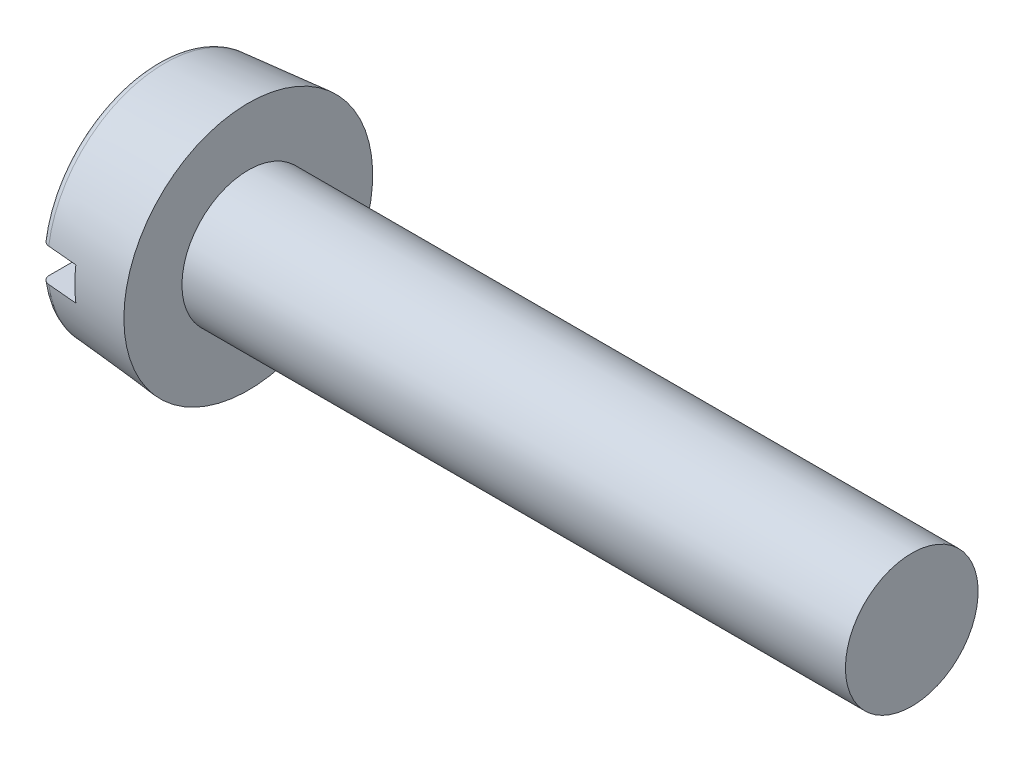
ISO-10303-21;
HEADER;
FILE_DESCRIPTION(('STEP AP214'),'2;1');
FILE_NAME('part.step','',(''),(''),'','','');
FILE_SCHEMA(('AUTOMOTIVE_DESIGN { 1 0 10303 214 1 1 1 1 }'));
ENDSEC;
DATA;
#1=APPLICATION_CONTEXT('core data for automotive mechanical design processes');
#2=APPLICATION_PROTOCOL_DEFINITION('international standard','automotive_design',2000,#1);
#3=PRODUCT_CONTEXT('',#1,'mechanical');
#4=PRODUCT('Part','Part','',(#3));
#5=PRODUCT_RELATED_PRODUCT_CATEGORY('part','',(#4));
#6=PRODUCT_DEFINITION_FORMATION('','',#4);
#7=PRODUCT_DEFINITION_CONTEXT('part definition',#1,'design');
#8=PRODUCT_DEFINITION('design','',#6,#7);
#9=PRODUCT_DEFINITION_SHAPE('','',#8);
#10=(LENGTH_UNIT() NAMED_UNIT(*) SI_UNIT(.MILLI.,.METRE.));
#11=(NAMED_UNIT(*) PLANE_ANGLE_UNIT() SI_UNIT($,.RADIAN.));
#12=(NAMED_UNIT(*) SI_UNIT($,.STERADIAN.) SOLID_ANGLE_UNIT());
#13=UNCERTAINTY_MEASURE_WITH_UNIT(LENGTH_MEASURE(1.E-05),#10,'distance_accuracy_value','');
#14=(GEOMETRIC_REPRESENTATION_CONTEXT(3) GLOBAL_UNCERTAINTY_ASSIGNED_CONTEXT((#13)) GLOBAL_UNIT_ASSIGNED_CONTEXT((#10,
#11,#12)) REPRESENTATION_CONTEXT('',''));
#15=CARTESIAN_POINT('',(0.,0.,0.));
#16=DIRECTION('',(0.,0.,1.));
#17=DIRECTION('',(1.,0.,0.));
#18=AXIS2_PLACEMENT_3D('',#15,#16,#17);
#19=CARTESIAN_POINT('',(0.,0.,0.));
#20=DIRECTION('',(-1.,0.,0.));
#21=DIRECTION('',(0.,0.,1.));
#22=AXIS2_PLACEMENT_3D('',#19,#20,#21);
#23=PLANE('',#22);
#24=DIRECTION('',(0.,0.,-1.));
#25=VECTOR('',#24,1.);
#26=CARTESIAN_POINT('',(0.,0.2,1.5));
#27=LINE('',#26,#25);
#28=CARTESIAN_POINT('',(0.,0.2,1.29679737749146));
#29=VERTEX_POINT('',#28);
#30=CARTESIAN_POINT('',(0.,0.2,-1.29679737749146));
#31=VERTEX_POINT('',#30);
#32=EDGE_CURVE('E104',#29,#31,#27,.T.);
#33=ORIENTED_EDGE('',*,*,#32,.F.);
#34=CARTESIAN_POINT('',(0.,0.,0.));
#35=DIRECTION('',(-1.,0.,0.));
#36=DIRECTION('',(0.,0.,1.));
#37=AXIS2_PLACEMENT_3D('',#34,#35,#36);
#38=CIRCLE('',#37,1.31212935271974);
#39=EDGE_CURVE('E106',#29,#31,#38,.T.);
#40=ORIENTED_EDGE('',*,*,#39,.T.);
#41=EDGE_LOOP('',(#33,#40));
#42=FACE_BOUND('',#41,.T.);
#43=ADVANCED_FACE('F35',(#42),#23,.T.);
#44=CARTESIAN_POINT('',(0.1,0.,0.));
#45=DIRECTION('',(-1.,0.,0.));
#46=DIRECTION('',(0.,0.,1.));
#47=AXIS2_PLACEMENT_3D('',#44,#45,#46);
#48=TOROIDAL_SURFACE('',#47,1.31212935271974,0.1);
#49=CARTESIAN_POINT('',(0.0414806405140106,0.2,-1.37878873869132));
#50=CARTESIAN_POINT('',(0.045992706268456,0.2,-1.38207872080672));
#51=CARTESIAN_POINT('',(0.0507840970123343,0.2,-1.384992124698));
#52=CARTESIAN_POINT('',(0.0607913614850068,0.2,-1.38997655926365));
#53=CARTESIAN_POINT('',(0.0660076927554337,0.2,-1.39204666716679));
#54=CARTESIAN_POINT('',(0.0767138026794469,0.2,-1.39527943903315));
#55=CARTESIAN_POINT('',(0.0822035244640968,0.2,-1.3964422908861));
#56=CARTESIAN_POINT('',(0.0932990891068805,0.2,-1.39782558793083));
#57=CARTESIAN_POINT('',(0.0989049042338715,0.2,-1.39804625563095));
#58=CARTESIAN_POINT('',(0.110053313509891,0.2,-1.39754017359693));
#59=CARTESIAN_POINT('',(0.115596062569045,0.2,-1.39681683029812));
#60=CARTESIAN_POINT('',(0.126481642138175,0.2,-1.39445028085468));
#61=CARTESIAN_POINT('',(0.131824467027574,0.2,-1.3928070488694));
#62=CARTESIAN_POINT('',(0.142162597863389,0.2,-1.38864842807059));
#63=CARTESIAN_POINT('',(0.147157700121292,0.2,-1.38613253314648));
#64=CARTESIAN_POINT('',(0.156658159294591,0.2,-1.38030289352851));
#65=CARTESIAN_POINT('',(0.161163504734715,0.2,-1.37698913014599));
#66=CARTESIAN_POINT('',(0.169588111305702,0.2,-1.36963647561987));
#67=CARTESIAN_POINT('',(0.173503473129932,0.2,-1.36559311777687));
#68=CARTESIAN_POINT('',(0.180607831648186,0.2,-1.35691211057948));
#69=CARTESIAN_POINT('',(0.183796794165209,0.2,-1.35227443327847));
#70=CARTESIAN_POINT('',(0.189391769491923,0.2,-1.3424874153805));
#71=CARTESIAN_POINT('',(0.191789700880553,0.2,-1.33733345509101));
#72=CARTESIAN_POINT('',(0.19569590317085,0.2,-1.32669877950339));
#73=CARTESIAN_POINT('',(0.197204123257214,0.2,-1.32121804556149));
#74=CARTESIAN_POINT('',(0.199302643953413,0.2,-1.31002730595364));
#75=CARTESIAN_POINT('',(0.199883711661166,0.2,-1.30431556796017));
#76=CARTESIAN_POINT('',(0.200084708962473,0.2,-1.29287512483865));
#77=CARTESIAN_POINT('',(0.199704598358244,0.2,-1.287146419011));
#78=CARTESIAN_POINT('',(0.197988994443503,0.2,-1.27579996619359));
#79=CARTESIAN_POINT('',(0.196648015633941,0.2,-1.27018304748093));
#80=CARTESIAN_POINT('',(0.193040788100539,0.2,-1.25925443041696));
#81=CARTESIAN_POINT('',(0.190774533693605,0.2,-1.25394273394057));
#82=CARTESIAN_POINT('',(0.18538205629663,0.2,-1.24378559136757));
#83=CARTESIAN_POINT('',(0.182257151707113,0.2,-1.23893944572103));
#84=CARTESIAN_POINT('',(0.175231140293912,0.2,-1.22984670234343));
#85=CARTESIAN_POINT('',(0.171330065880049,0.2,-1.22560007959128));
#86=CARTESIAN_POINT('',(0.162899083220666,0.2,-1.21786965873921));
#87=CARTESIAN_POINT('',(0.158375208316466,0.2,-1.21437928244762));
#88=CARTESIAN_POINT('',(0.148799353097061,0.2,-1.20821933397743));
#89=CARTESIAN_POINT('',(0.143747412157135,0.2,-1.20554970065849));
#90=CARTESIAN_POINT('',(0.133328828939664,0.2,-1.20114330406563));
#91=CARTESIAN_POINT('',(0.127967091422443,0.2,-1.19939494244297));
#92=CARTESIAN_POINT('',(0.117024703752107,0.2,-1.19683371135137));
#93=CARTESIAN_POINT('',(0.111444068408559,0.2,-1.19602077870833));
#94=CARTESIAN_POINT('',(0.100283556423155,0.2,-1.19535934874535));
#95=CARTESIAN_POINT('',(0.0947042584312154,0.2,-1.19550105044551));
#96=CARTESIAN_POINT('',(0.0836492282236536,0.2,-1.19672136311714));
#97=CARTESIAN_POINT('',(0.0781734935834735,0.2,-1.197799952127));
#98=CARTESIAN_POINT('',(0.0674919809063741,0.2,-1.20085751924297));
#99=CARTESIAN_POINT('',(0.0622856685568473,0.2,-1.20283463270732));
#100=CARTESIAN_POINT('',(0.0522755234585236,0.2,-1.20762882764349));
#101=CARTESIAN_POINT('',(0.0474717016780087,0.2,-1.2104459319964));
#102=CARTESIAN_POINT('',(0.038364797689681,0.2,-1.2168597921199));
#103=CARTESIAN_POINT('',(0.03406554388611,0.2,-1.22046198166932));
#104=CARTESIAN_POINT('',(0.0261235169004913,0.2,-1.22832895956775));
#105=CARTESIAN_POINT('',(0.0224807858537098,0.2,-1.23259379041202));
#106=CARTESIAN_POINT('',(0.0159068726282138,0.2,-1.24172167849697));
#107=CARTESIAN_POINT('',(0.0129851152821255,0.2,-1.24659152346576));
#108=CARTESIAN_POINT('',(0.00798981751689208,0.2,-1.25674837943574));
#109=CARTESIAN_POINT('',(0.00591633420418645,0.2,-1.26203541849418));
#110=CARTESIAN_POINT('',(0.00265314843626462,0.2,-1.27294200497139));
#111=CARTESIAN_POINT('',(0.00147388322806701,0.2,-1.27856467692328));
#112=CARTESIAN_POINT('',(7.04341788945292E-05,0.2,-1.28992785871544));
#113=CARTESIAN_POINT('',(-0.000153748687010346,0.2,-1.29566836867603));
#114=CARTESIAN_POINT('',(0.000361012752478395,0.2,-1.30713657329263));
#115=CARTESIAN_POINT('',(0.00110504408471955,0.2,-1.31286404059237));
#116=CARTESIAN_POINT('',(0.00354671167517866,0.2,-1.32411374262448));
#117=CARTESIAN_POINT('',(0.00524458054571486,0.2,-1.32963592694413));
#118=CARTESIAN_POINT('',(0.00954431574689398,0.2,-1.34030328003271));
#119=CARTESIAN_POINT('',(0.0121443890017295,0.2,-1.34544917228006));
#120=CARTESIAN_POINT('',(0.018177136481899,0.2,-1.35522154229951));
#121=CARTESIAN_POINT('',(0.0216087742263154,0.2,-1.35984865626817));
#122=CARTESIAN_POINT('',(0.0278105047502973,0.2,-1.36686955431054));
#123=CARTESIAN_POINT('',(0.0303616325878246,0.2,-1.36946003192939));
#124=CARTESIAN_POINT('',(0.0357293321890374,0.2,-1.37434968831504));
#125=CARTESIAN_POINT('',(0.0385459026655175,0.2,-1.37664886849429));
#126=CARTESIAN_POINT('',(0.0414806405140106,0.2,-1.37878873869132));
#127=B_SPLINE_CURVE_WITH_KNOTS('',3,(#49,#50,#51,#52,#53,#54,#55,#56,#57,#58,#59,#60,#61,#62,
#63,#64,#65,#66,#67,#68,#69,#70,#71,#72,#73,#74,#75,#76,#77,#78,#79,#80,#81,#82,#83,#84,#85,#86,
#87,#88,#89,#90,#91,#92,#93,#94,#95,#96,#97,#98,#99,#100,#101,#102,#103,#104,#105,#106,#107,
#108,#109,#110,#111,#112,#113,#114,#115,#116,#117,#118,#119,#120,#121,#122,#123,#124,#125,#126),
.UNSPECIFIED.,.T.,.F.,(4,2,2,2,2,2,2,2,2,2,2,2,2,2,2,2,2,2,2,2,2,2,2,2,2,2,2,2,2,2,2,2,2,2,2,2,
2,2,4),(0.,0.0167393128294365,0.0334968936586767,0.0502510031263279,0.0670011556866522,
0.0836910326253862,0.100381378423866,0.117081420203452,0.133781853189951,0.150588230195742,
0.167395397776329,0.184369307268852,0.201344186121747,0.218487074698843,0.235630680226664,
0.25287294469584,0.270115315069563,0.287331357453451,0.30454668111342,0.321605642871932,
0.338663333533964,0.355500810610574,0.372337150503218,0.389000901452267,0.40566426179629,
0.422293198693181,0.438922588598416,0.455670952608406,0.472420391136634,0.489378389754252,
0.506337529809178,0.523491691763249,0.540645871230475,0.557890544200038,0.575139424453957,
0.592354218129328,0.609547664273803,0.620435301069003,0.631322885069728),.UNSPECIFIED.);
#128=CARTESIAN_POINT('',(0.0912844257255021,0.2,-1.39751019242307));
#129=VERTEX_POINT('',#128);
#130=EDGE_CURVE('E59',#31,#129,#127,.T.);
#131=ORIENTED_EDGE('',*,*,#130,.F.);
#132=ORIENTED_EDGE('',*,*,#39,.F.);
#133=CARTESIAN_POINT('',(0.0307819679804513,0.2,1.22372100362098));
#134=CARTESIAN_POINT('',(0.0347984727964817,0.2,1.2198181323119));
#135=CARTESIAN_POINT('',(0.0391440859190338,0.2,1.21624856527496));
#136=CARTESIAN_POINT('',(0.0483749943226639,0.2,1.20988450674902));
#137=CARTESIAN_POINT('',(0.0532608509416966,0.2,1.20709083223231));
#138=CARTESIAN_POINT('',(0.0634341852694045,0.2,1.20236616989635));
#139=CARTESIAN_POINT('',(0.0687216716373827,0.2,1.20043520068357));
#140=CARTESIAN_POINT('',(0.0795460311047977,0.2,1.19749672442106));
#141=CARTESIAN_POINT('',(0.085082841985754,0.2,1.19648898830541));
#142=CARTESIAN_POINT('',(0.0962052821839367,0.2,1.19543166840146));
#143=CARTESIAN_POINT('',(0.101790235157893,0.2,1.19537496403138));
#144=CARTESIAN_POINT('',(0.11288990404888,0.2,1.19620324026988));
#145=CARTESIAN_POINT('',(0.118404619469681,0.2,1.19708822752781));
#146=CARTESIAN_POINT('',(0.129190042563905,0.2,1.19976830100141));
#147=CARTESIAN_POINT('',(0.13446144689838,0.2,1.20156058690718));
#148=CARTESIAN_POINT('',(0.144631252407818,0.2,1.2059993116385));
#149=CARTESIAN_POINT('',(0.149529645729798,0.2,1.20864576844073));
#150=CARTESIAN_POINT('',(0.158848822688909,0.2,1.21473343117123));
#151=CARTESIAN_POINT('',(0.163266401386561,0.2,1.21817954121337));
#152=CARTESIAN_POINT('',(0.171469077513323,0.2,1.22575630231456));
#153=CARTESIAN_POINT('',(0.175254137803147,0.2,1.22988699354151));
#154=CARTESIAN_POINT('',(0.182133700549108,0.2,1.23876924128591));
#155=CARTESIAN_POINT('',(0.185219228809023,0.2,1.24352774826054));
#156=CARTESIAN_POINT('',(0.190558601135525,0.2,1.25349047166616));
#157=CARTESIAN_POINT('',(0.192812388984713,0.2,1.25869471819543));
#158=CARTESIAN_POINT('',(0.196450900985209,0.2,1.26946767434103));
#159=CARTESIAN_POINT('',(0.197824993630129,0.2,1.27503997639372));
#160=CARTESIAN_POINT('',(0.199624620171047,0.2,1.28633578370974));
#161=CARTESIAN_POINT('',(0.200050113493286,0.2,1.29205929543005));
#162=CARTESIAN_POINT('',(0.199940149302512,0.2,1.30353259953747));
#163=CARTESIAN_POINT('',(0.199398749112752,0.2,1.30928233630723));
#164=CARTESIAN_POINT('',(0.197356810660867,0.2,1.32060904673091));
#165=CARTESIAN_POINT('',(0.19585627018755,0.2,1.32618601998652));
#166=CARTESIAN_POINT('',(0.19193877358236,0.2,1.33699794176707));
#167=CARTESIAN_POINT('',(0.18952334691576,0.2,1.34223344411769));
#168=CARTESIAN_POINT('',(0.183840984141119,0.2,1.3522201065835));
#169=CARTESIAN_POINT('',(0.180574079318981,0.2,1.35697128448533));
#170=CARTESIAN_POINT('',(0.173308450638201,0.2,1.36581299081948));
#171=CARTESIAN_POINT('',(0.169315781908923,0.2,1.36990849402998));
#172=CARTESIAN_POINT('',(0.160693107410107,0.2,1.37736235484011));
#173=CARTESIAN_POINT('',(0.156063138036668,0.2,1.38072075450717));
#174=CARTESIAN_POINT('',(0.146349474679739,0.2,1.38656781412274));
#175=CARTESIAN_POINT('',(0.141271049827143,0.2,1.38906522819464));
#176=CARTESIAN_POINT('',(0.130764444251643,0.2,1.39316337799611));
#177=CARTESIAN_POINT('',(0.125336282236047,0.2,1.39476416164177));
#178=CARTESIAN_POINT('',(0.114335380158321,0.2,1.39701043035063));
#179=CARTESIAN_POINT('',(0.10876432073887,0.2,1.39766415168206));
#180=CARTESIAN_POINT('',(0.0975918067789705,0.2,1.39802299033389));
#181=CARTESIAN_POINT('',(0.0919903531471776,0.2,1.39772813585832));
#182=CARTESIAN_POINT('',(0.0809388039751648,0.2,1.39620176248313));
#183=CARTESIAN_POINT('',(0.0754882068414214,0.2,1.39497387054489));
#184=CARTESIAN_POINT('',(0.0648698422524552,0.2,1.39162243053316));
#185=CARTESIAN_POINT('',(0.0597020751209219,0.2,1.38949888143465));
#186=CARTESIAN_POINT('',(0.049782502927804,0.2,1.38441312808557));
#187=CARTESIAN_POINT('',(0.0450316678762765,0.2,1.38144903263922));
#188=CARTESIAN_POINT('',(0.0360902176627494,0.2,1.3747709553496));
#189=CARTESIAN_POINT('',(0.0318996217996732,0.2,1.37105694768467));
#190=CARTESIAN_POINT('',(0.024162729133194,0.2,1.36295514115609));
#191=CARTESIAN_POINT('',(0.0206215709141188,0.2,1.35856243612017));
#192=CARTESIAN_POINT('',(0.0143180732840832,0.2,1.34924994940869));
#193=CARTESIAN_POINT('',(0.0115557764252828,0.2,1.34433013895562));
#194=CARTESIAN_POINT('',(0.00685818762411474,0.2,1.33404877647173));
#195=CARTESIAN_POINT('',(0.00493173512818565,0.2,1.32868318557478));
#196=CARTESIAN_POINT('',(0.00199785794876375,0.2,1.31770658058517));
#197=CARTESIAN_POINT('',(0.000990448190180537,0.2,1.31209556250842));
#198=CARTESIAN_POINT('',(-8.49088821446887E-05,0.2,1.30073278631482));
#199=CARTESIAN_POINT('',(-0.000144255464417129,0.2,1.29498021340047));
#200=CARTESIAN_POINT('',(0.000699530031690524,0.2,1.28354443767004));
#201=CARTESIAN_POINT('',(0.00160292952556717,0.2,1.27786125457151));
#202=CARTESIAN_POINT('',(0.00435384704478954,0.2,1.26670152791589));
#203=CARTESIAN_POINT('',(0.00620556811890471,0.2,1.26122602183738));
#204=CARTESIAN_POINT('',(0.0108044753944551,0.2,1.2506700738542));
#205=CARTESIAN_POINT('',(0.0135505940789249,0.2,1.24558916987792));
#206=CARTESIAN_POINT('',(0.0187303349525876,0.2,1.23769052654243));
#207=CARTESIAN_POINT('',(0.0209246769906487,0.2,1.23471309911621));
#208=CARTESIAN_POINT('',(0.0256255882604242,0.2,1.22901575974777));
#209=CARTESIAN_POINT('',(0.028132156835413,0.2,1.22629584726394));
#210=CARTESIAN_POINT('',(0.0307819679804513,0.2,1.22372100362098));
#211=B_SPLINE_CURVE_WITH_KNOTS('',3,(#133,#134,#135,#136,#137,#138,#139,#140,#141,#142,#143,
#144,#145,#146,#147,#148,#149,#150,#151,#152,#153,#154,#155,#156,#157,#158,#159,#160,#161,#162,
#163,#164,#165,#166,#167,#168,#169,#170,#171,#172,#173,#174,#175,#176,#177,#178,#179,#180,#181,
#182,#183,#184,#185,#186,#187,#188,#189,#190,#191,#192,#193,#194,#195,#196,#197,#198,#199,#200,
#201,#202,#203,#204,#205,#206,#207,#208,#209,#210),.UNSPECIFIED.,.T.,.F.,(4,2,2,2,2,2,2,2,2,2,2,
2,2,2,2,2,2,2,2,2,2,2,2,2,2,2,2,2,2,2,2,2,2,2,2,2,2,2,4),(0.,0.016787993437749,
0.0335935972682153,0.0503995635373339,0.0672013589012236,0.0838772989304653,0.100553356710426,
0.117178256056369,0.133803505308781,0.150533542372957,0.167264561421968,0.184199400170769,
0.201135383337108,0.218272363003169,0.235410075642888,0.252653482066208,0.269896928242459,
0.287111673936358,0.30432578719719,0.32140237427785,0.338477986522678,0.355374473194497,
0.372270056828819,0.389017804732743,0.40576505468011,0.422447534613202,0.439130033638441,
0.455850369558511,0.472571281306527,0.489419268740166,0.506268176465197,0.523291166263116,
0.540314432503088,0.557492045246825,0.574674430544321,0.591933637435246,0.60917231946371,
0.620247895796481,0.631323448833697),.UNSPECIFIED.);
#212=CARTESIAN_POINT('',(0.0912844257252299,0.2,1.39751019241785));
#213=VERTEX_POINT('',#212);
#214=EDGE_CURVE('E96',#213,#29,#211,.T.);
#215=ORIENTED_EDGE('',*,*,#214,.F.);
#216=CARTESIAN_POINT('',(0.0912844257252299,0.,0.));
#217=DIRECTION('',(-1.,0.,0.));
#218=DIRECTION('',(0.,0.,1.));
#219=AXIS2_PLACEMENT_3D('',#216,#217,#218);
#220=CIRCLE('',#219,1.41174882252892);
#221=EDGE_CURVE('E110',#129,#213,#220,.F.);
#222=ORIENTED_EDGE('',*,*,#221,.F.);
#223=EDGE_LOOP('',(#131,#132,#215,#222));
#224=FACE_BOUND('',#223,.T.);
#225=ADVANCED_FACE('F187',(#224),#48,.T.);
#226=CARTESIAN_POINT('',(-25.4,0.,0.));
#227=DIRECTION('',(-1.,0.,0.));
#228=DIRECTION('',(0.,0.,1.));
#229=AXIS2_PLACEMENT_3D('',#226,#227,#228);
#230=CYLINDRICAL_SURFACE('',#229,0.8);
#231=CARTESIAN_POINT('',(9.1,0.,0.));
#232=DIRECTION('',(-1.,0.,0.));
#233=DIRECTION('',(0.,0.,1.));
#234=AXIS2_PLACEMENT_3D('',#231,#232,#233);
#235=CIRCLE('',#234,0.8);
#236=CARTESIAN_POINT('',(9.1,0.,0.8));
#237=VERTEX_POINT('',#236);
#238=EDGE_CURVE('E107',#237,#237,#235,.T.);
#239=ORIENTED_EDGE('',*,*,#238,.T.);
#240=EDGE_LOOP('',(#239));
#241=FACE_BOUND('',#240,.T.);
#242=CARTESIAN_POINT('',(1.1,0.,0.));
#243=DIRECTION('',(-1.,0.,0.));
#244=DIRECTION('',(0.,0.,1.));
#245=AXIS2_PLACEMENT_3D('',#242,#243,#244);
#246=CIRCLE('',#245,0.8);
#247=CARTESIAN_POINT('',(1.1,0.,0.8));
#248=VERTEX_POINT('',#247);
#249=EDGE_CURVE('E174',#248,#248,#246,.T.);
#250=ORIENTED_EDGE('',*,*,#249,.F.);
#251=EDGE_LOOP('',(#250));
#252=FACE_BOUND('',#251,.T.);
#253=ADVANCED_FACE('F184',(#241,#252),#230,.T.);
#254=CARTESIAN_POINT('',(9.1,0.8,0.));
#255=DIRECTION('',(1.,0.,0.));
#256=DIRECTION('',(0.,0.,-1.));
#257=AXIS2_PLACEMENT_3D('',#254,#255,#256);
#258=PLANE('',#257);
#259=ORIENTED_EDGE('',*,*,#238,.F.);
#260=EDGE_LOOP('',(#259));
#261=FACE_BOUND('',#260,.T.);
#262=ADVANCED_FACE('F186',(#261),#258,.T.);
#263=DIRECTION('',(0.,0.,1.));
#264=VECTOR('',#263,1.);
#265=CARTESIAN_POINT('',(0.,-0.2,-1.5));
#266=LINE('',#265,#264);
#267=CARTESIAN_POINT('',(0.,-0.2,-1.29679737749146));
#268=VERTEX_POINT('',#267);
#269=CARTESIAN_POINT('',(0.,-0.2,1.29679737749146));
#270=VERTEX_POINT('',#269);
#271=EDGE_CURVE('E51',#268,#270,#266,.T.);
#272=ORIENTED_EDGE('',*,*,#271,.F.);
#273=EDGE_CURVE('E102',#268,#270,#38,.T.);
#274=ORIENTED_EDGE('',*,*,#273,.T.);
#275=EDGE_LOOP('',(#272,#274));
#276=FACE_BOUND('',#275,.T.);
#277=ADVANCED_FACE('F101',(#276),#23,.T.);
#278=CARTESIAN_POINT('',(0.,0.,0.));
#279=DIRECTION('',(1.,0.,0.));
#280=DIRECTION('',(0.,0.,-1.));
#281=AXIS2_PLACEMENT_3D('',#278,#279,#280);
#282=CONICAL_SURFACE('',#281,1.40376247012148,0.0872664625997166);
#283=CARTESIAN_POINT('',(-2.36647961207685,0.2,-1.17989166407303));
#284=CARTESIAN_POINT('',(-1.63549617754105,0.2,-1.244750748797));
#285=CARTESIAN_POINT('',(-0.904500881789516,0.2,-1.30947589625299));
#286=CARTESIAN_POINT('',(-0.0339239552641283,0.2,-1.38644461300873));
#287=CARTESIAN_POINT('',(0.105649474170376,0.2,-1.3987809255748));
#288=CARTESIAN_POINT('',(1.11580383483633,0.2,-1.48804057032924));
#289=CARTESIAN_POINT('',(1.98639564424796,0.2,-1.5648408377888));
#290=CARTESIAN_POINT('',(2.8569929609533,0.2,-1.64157844879992));
#291=B_SPLINE_CURVE_WITH_KNOTS('',3,(#283,#284,#285,#286,#287,#288,#289,#290),.UNSPECIFIED.,.F.,
.F.,(4,2,2,4),(0.,2.20156561324364,2.62191825234238,5.24383648132487),.UNSPECIFIED.);
#292=CARTESIAN_POINT('',(0.45,0.2,-1.42920643491876));
#293=VERTEX_POINT('',#292);
#294=EDGE_CURVE('E168',#129,#293,#291,.T.);
#295=ORIENTED_EDGE('',*,*,#294,.F.);
#296=ORIENTED_EDGE('',*,*,#221,.T.);
#297=CARTESIAN_POINT('',(2.8569929609533,0.2,1.64157844879992));
#298=CARTESIAN_POINT('',(2.42169403289325,0.2,1.60321262507228));
#299=CARTESIAN_POINT('',(1.98639673794916,0.2,1.56482825959469));
#300=CARTESIAN_POINT('',(1.11580646674958,0.2,1.4880106918634));
#301=CARTESIAN_POINT('',(0.680513490493985,0.2,1.44957748961075));
#302=CARTESIAN_POINT('',(-0.190067113434549,0.2,1.37265049306465));
#303=CARTESIAN_POINT('',(-0.62535474110744,0.2,1.33415669877062));
#304=CARTESIAN_POINT('',(-1.49592291976096,0.2,1.257089071638));
#305=CARTESIAN_POINT('',(-1.93120347074144,0.2,1.21851523879768));
#306=CARTESIAN_POINT('',(-2.36647961207685,0.2,1.17989166407303));
#307=B_SPLINE_CURVE_WITH_KNOTS('',3,(#297,#298,#299,#300,#301,#302,#303,#304,#305,#306),
.UNSPECIFIED.,.F.,.F.,(4,2,2,2,4),(0.,1.3109591304441,2.62191823310793,3.93287734816139,
5.24383649122666),.UNSPECIFIED.);
#308=CARTESIAN_POINT('',(0.45,0.2,1.42920643491876));
#309=VERTEX_POINT('',#308);
#310=EDGE_CURVE('E163',#309,#213,#307,.T.);
#311=ORIENTED_EDGE('',*,*,#310,.F.);
#312=CARTESIAN_POINT('',(0.45,0.,0.));
#313=DIRECTION('',(-1.,0.,0.));
#314=DIRECTION('',(0.,0.,1.));
#315=AXIS2_PLACEMENT_3D('',#312,#313,#314);
#316=CIRCLE('',#315,1.44313236870815);
#317=CARTESIAN_POINT('',(0.45,-0.2,1.42920643491876));
#318=VERTEX_POINT('',#317);
#319=EDGE_CURVE('E40',#309,#318,#316,.F.);
#320=ORIENTED_EDGE('',*,*,#319,.T.);
#321=CARTESIAN_POINT('',(-2.36647961207685,-0.2,1.17989166407303));
#322=CARTESIAN_POINT('',(-1.63549617754107,-0.2,1.244750748797));
#323=CARTESIAN_POINT('',(-0.904500881789519,-0.2,1.30947589625299));
#324=CARTESIAN_POINT('',(-0.0339239552641277,-0.2,1.38644461300873));
#325=CARTESIAN_POINT('',(0.105649474170377,-0.2,1.3987809255748));
#326=CARTESIAN_POINT('',(1.11580383483633,-0.2,1.48804057032924));
#327=CARTESIAN_POINT('',(1.98639564424793,-0.2,1.5648408377888));
#328=CARTESIAN_POINT('',(2.8569929609533,-0.2,1.64157844879992));
#329=B_SPLINE_CURVE_WITH_KNOTS('',3,(#321,#322,#323,#324,#325,#326,#327,#328),.UNSPECIFIED.,.F.,
.F.,(4,2,2,4),(0.,2.20156561324364,2.62191825234238,5.24383648132487),.UNSPECIFIED.);
#330=CARTESIAN_POINT('',(0.091284425725231,-0.2,1.39751019241794));
#331=VERTEX_POINT('',#330);
#332=EDGE_CURVE('E139',#331,#318,#329,.T.);
#333=ORIENTED_EDGE('',*,*,#332,.F.);
#334=CARTESIAN_POINT('',(0.0912844257252301,-0.2,-1.39751019241785));
#335=VERTEX_POINT('',#334);
#336=EDGE_CURVE('E116',#331,#335,#220,.F.);
#337=ORIENTED_EDGE('',*,*,#336,.T.);
#338=CARTESIAN_POINT('',(2.8569929609533,-0.2,-1.64157844879992));
#339=CARTESIAN_POINT('',(2.42169403289325,-0.2,-1.60321262507228));
#340=CARTESIAN_POINT('',(1.98639673794916,-0.2,-1.56482825959469));
#341=CARTESIAN_POINT('',(1.11580646674958,-0.2,-1.4880106918634));
#342=CARTESIAN_POINT('',(0.680513490493985,-0.2,-1.44957748961075));
#343=CARTESIAN_POINT('',(-0.190067113434549,-0.2,-1.37265049306465));
#344=CARTESIAN_POINT('',(-0.62535474110744,-0.2,-1.33415669877062));
#345=CARTESIAN_POINT('',(-1.49592291976096,-0.2,-1.257089071638));
#346=CARTESIAN_POINT('',(-1.93120347074144,-0.2,-1.21851523879768));
#347=CARTESIAN_POINT('',(-2.36647961207685,-0.2,-1.17989166407303));
#348=B_SPLINE_CURVE_WITH_KNOTS('',3,(#338,#339,#340,#341,#342,#343,#344,#345,#346,#347),
.UNSPECIFIED.,.F.,.F.,(4,2,2,2,4),(0.,1.3109591304441,2.62191823310793,3.93287734816139,
5.24383649122666),.UNSPECIFIED.);
#349=CARTESIAN_POINT('',(0.45,-0.2,-1.42920643491876));
#350=VERTEX_POINT('',#349);
#351=EDGE_CURVE('E91',#350,#335,#348,.T.);
#352=ORIENTED_EDGE('',*,*,#351,.F.);
#353=EDGE_CURVE('E11',#350,#293,#316,.F.);
#354=ORIENTED_EDGE('',*,*,#353,.T.);
#355=EDGE_LOOP('',(#295,#296,#311,#320,#333,#337,#352,#354));
#356=FACE_BOUND('',#355,.T.);
#357=CARTESIAN_POINT('',(1.1,0.,0.));
#358=DIRECTION('',(-1.,0.,0.));
#359=DIRECTION('',(0.,0.,1.));
#360=AXIS2_PLACEMENT_3D('',#357,#358,#359);
#361=CIRCLE('',#360,1.5);
#362=CARTESIAN_POINT('',(1.1,0.,1.5));
#363=VERTEX_POINT('',#362);
#364=EDGE_CURVE('E112',#363,#363,#361,.T.);
#365=ORIENTED_EDGE('',*,*,#364,.T.);
#366=EDGE_LOOP('',(#365));
#367=FACE_BOUND('',#366,.T.);
#368=ADVANCED_FACE('F152',(#356,#367),#282,.T.);
#369=CARTESIAN_POINT('',(1.1,0.8,0.));
#370=DIRECTION('',(-1.,0.,0.));
#371=DIRECTION('',(0.,0.,1.));
#372=AXIS2_PLACEMENT_3D('',#369,#370,#371);
#373=PLANE('',#372);
#374=ORIENTED_EDGE('',*,*,#364,.F.);
#375=EDGE_LOOP('',(#374));
#376=FACE_BOUND('',#375,.T.);
#377=ORIENTED_EDGE('',*,*,#249,.T.);
#378=EDGE_LOOP('',(#377));
#379=FACE_BOUND('',#378,.T.);
#380=ADVANCED_FACE('F156',(#376,#379),#373,.F.);
#381=CARTESIAN_POINT('',(0.0414806405140106,-0.2,-1.37878873869132));
#382=CARTESIAN_POINT('',(0.0369064862336145,-0.2,-1.37545285511304));
#383=CARTESIAN_POINT('',(0.0326127667721604,-0.2,-1.37172498298359));
#384=CARTESIAN_POINT('',(0.0247106167392446,-0.2,-1.36359626522592));
#385=CARTESIAN_POINT('',(0.0211031006888838,-0.2,-1.35919453542804));
#386=CARTESIAN_POINT('',(0.0146792731553045,-0.2,-1.34985300616529));
#387=CARTESIAN_POINT('',(0.0118622321095021,-0.2,-1.34491370872767));
#388=CARTESIAN_POINT('',(0.00709103039015898,-0.2,-1.33463655500174));
#389=CARTESIAN_POINT('',(0.00513665674506683,-0.2,-1.32929879746439));
#390=CARTESIAN_POINT('',(0.0021285911336658,-0.2,-1.31833113100948));
#391=CARTESIAN_POINT('',(0.00108192960007987,-0.2,-1.31269929367195));
#392=CARTESIAN_POINT('',(-5.84898654237496E-05,-0.2,-1.30133965062579));
#393=CARTESIAN_POINT('',(-0.000152162882158001,-0.2,-1.29561183641078));
#394=CARTESIAN_POINT('',(0.000617896637881445,-0.2,-1.28417973559155));
#395=CARTESIAN_POINT('',(0.00148845966503694,-0.2,-1.27847590786062));
#396=CARTESIAN_POINT('',(0.00417422531135044,-0.2,-1.2672950111756));
#397=CARTESIAN_POINT('',(0.00598944207101236,-0.2,-1.26181794561725));
#398=CARTESIAN_POINT('',(0.0105167095169795,-0.2,-1.25124485837488));
#399=CARTESIAN_POINT('',(0.0132291497562422,-0.2,-1.24614900338381));
#400=CARTESIAN_POINT('',(0.0194770974583093,-0.2,-1.23648945489062));
#401=CARTESIAN_POINT('',(0.0230125784070485,-0.2,-1.2319257442527));
#402=CARTESIAN_POINT('',(0.0307799390434746,-0.2,-1.22349787867142));
#403=CARTESIAN_POINT('',(0.0350064631744044,-0.2,-1.21962878966363));
#404=CARTESIAN_POINT('',(0.0440561835219944,-0.2,-1.21266591432931));
#405=CARTESIAN_POINT('',(0.0488793389323313,-0.2,-1.20957207502368));
#406=CARTESIAN_POINT('',(0.0589208707800799,-0.2,-1.2042890019216));
#407=CARTESIAN_POINT('',(0.0641335466495716,-0.2,-1.20208893324555));
#408=CARTESIAN_POINT('',(0.0748569693537311,-0.2,-1.19860679091014));
#409=CARTESIAN_POINT('',(0.0803676941840457,-0.2,-1.19732464958129));
#410=CARTESIAN_POINT('',(0.0914625501738262,-0.2,-1.19572801414384));
#411=CARTESIAN_POINT('',(0.0970451024818687,-0.2,-1.19540253409331));
#412=CARTESIAN_POINT('',(0.108184973406478,-0.2,-1.19569802724482));
#413=CARTESIAN_POINT('',(0.1137422929354,-0.2,-1.19631896594889));
#414=CARTESIAN_POINT('',(0.124648734101948,-0.2,-1.19848311182653));
#415=CARTESIAN_POINT('',(0.129998662258609,-0.2,-1.20002226041911));
#416=CARTESIAN_POINT('',(0.14036612700605,-0.2,-1.20397245900681));
#417=CARTESIAN_POINT('',(0.14538365819404,-0.2,-1.20638352316995));
#418=CARTESIAN_POINT('',(0.154972642758457,-0.2,-1.21201981688882));
#419=CARTESIAN_POINT('',(0.159541698706173,-0.2,-1.215249123153));
#420=CARTESIAN_POINT('',(0.168080823285296,-0.2,-1.22242073687449));
#421=CARTESIAN_POINT('',(0.172050857974734,-0.2,-1.22636308470665));
#422=CARTESIAN_POINT('',(0.179329246466521,-0.2,-1.23489775272775));
#423=CARTESIAN_POINT('',(0.182629313991137,-0.2,-1.2394971387777));
#424=CARTESIAN_POINT('',(0.188421528540227,-0.2,-1.2491791983111));
#425=CARTESIAN_POINT('',(0.19091362093191,-0.2,-1.25426190444514));
#426=CARTESIAN_POINT('',(0.195050170911492,-0.2,-1.26483358048604));
#427=CARTESIAN_POINT('',(0.196683831650684,-0.2,-1.27032677659078));
#428=CARTESIAN_POINT('',(0.199013177508796,-0.2,-1.28150863542787));
#429=CARTESIAN_POINT('',(0.19970881728523,-0.2,-1.2871973075956));
#430=CARTESIAN_POINT('',(0.200144660189995,-0.2,-1.29865232583121));
#431=CARTESIAN_POINT('',(0.199877954817747,-0.2,-1.3044189362796));
#432=CARTESIAN_POINT('',(0.198379773589644,-0.2,-1.31582557494282));
#433=CARTESIAN_POINT('',(0.197148290772392,-0.2,-1.32146560224399));
#434=CARTESIAN_POINT('',(0.193753551348259,-0.2,-1.33245457904034));
#435=CARTESIAN_POINT('',(0.191590828581459,-0.2,-1.33780369332777));
#436=CARTESIAN_POINT('',(0.186391622806081,-0.2,-1.34805912673939));
#437=CARTESIAN_POINT('',(0.183355166101014,-0.2,-1.35296545918756));
#438=CARTESIAN_POINT('',(0.17651718907122,-0.2,-1.36215681888547));
#439=CARTESIAN_POINT('',(0.172721411548491,-0.2,-1.36644611750493));
#440=CARTESIAN_POINT('',(0.164456817438278,-0.2,-1.37431827808717));
#441=CARTESIAN_POINT('',(0.159988037070745,-0.2,-1.37790117804327));
#442=CARTESIAN_POINT('',(0.150554066505534,-0.2,-1.38421922583436));
#443=CARTESIAN_POINT('',(0.145594513354818,-0.2,-1.38696279100932));
#444=CARTESIAN_POINT('',(0.135282242427973,-0.2,-1.39156926296415));
#445=CARTESIAN_POINT('',(0.129929562162698,-0.2,-1.39343225363962));
#446=CARTESIAN_POINT('',(0.119036587650446,-0.2,-1.39620799903314));
#447=CARTESIAN_POINT('',(0.11349850983111,-0.2,-1.39712945742233));
#448=CARTESIAN_POINT('',(0.102344789571562,-0.2,-1.39802482528426));
#449=CARTESIAN_POINT('',(0.0967291303583609,-0.2,-1.39799852654418));
#450=CARTESIAN_POINT('',(0.0856068356646958,-0.2,-1.3970011383531));
#451=CARTESIAN_POINT('',(0.0800998414267417,-0.2,-1.39603401623494));
#452=CARTESIAN_POINT('',(0.0693310132651625,-0.2,-1.39319017215175));
#453=CARTESIAN_POINT('',(0.0640688865136559,-0.2,-1.39131456893088));
#454=CARTESIAN_POINT('',(0.0559187324032362,-0.2,-1.38761401940423));
#455=CARTESIAN_POINT('',(0.0529066554723136,-0.2,-1.38605580212753));
#456=CARTESIAN_POINT('',(0.047056447833328,-0.2,-1.38264144049343));
#457=CARTESIAN_POINT('',(0.044218316349304,-0.2,-1.38078529746519));
#458=CARTESIAN_POINT('',(0.0414806405140106,-0.2,-1.37878873869132));
#459=B_SPLINE_CURVE_WITH_KNOTS('',3,(#381,#382,#383,#384,#385,#386,#387,#388,#389,#390,#391,
#392,#393,#394,#395,#396,#397,#398,#399,#400,#401,#402,#403,#404,#405,#406,#407,#408,#409,#410,
#411,#412,#413,#414,#415,#416,#417,#418,#419,#420,#421,#422,#423,#424,#425,#426,#427,#428,#429,
#430,#431,#432,#433,#434,#435,#436,#437,#438,#439,#440,#441,#442,#443,#444,#445,#446,#447,#448,
#449,#450,#451,#452,#453,#454,#455,#456,#457,#458),.UNSPECIFIED.,.T.,.F.,(4,2,2,2,2,2,2,2,2,2,2,
2,2,2,2,2,2,2,2,2,2,2,2,2,2,2,2,2,2,2,2,2,2,2,2,2,2,2,4),(0.,0.0169715521723573,
0.0339655666849416,0.0509438447289723,0.0679179289025333,0.0850223361763873,0.102128267509698,
0.119356153905261,0.136584298192148,0.153819932366605,0.171055011375926,0.188162352773011,
0.20526852476756,0.22216064786739,0.239051525553707,0.255747661890334,0.272443189649427,
0.289065462632995,0.305688005729256,0.322395053845562,0.339103048267745,0.356006551761102,
0.372911197979089,0.390023658116989,0.407136945415172,0.424373329526424,0.441609838008787,
0.458836478664654,0.476062600771673,0.493163056791891,0.510262592821216,0.5271845536268,
0.544104901888843,0.560867380696604,0.577633542077063,0.594329307793428,0.6110045656694,
0.621162250064078,0.631319889142588),.UNSPECIFIED.);
#460=EDGE_CURVE('E87',#335,#268,#459,.T.);
#461=ORIENTED_EDGE('',*,*,#460,.F.);
#462=ORIENTED_EDGE('',*,*,#336,.F.);
#463=CARTESIAN_POINT('',(0.0307819679804513,-0.2,1.22372100362098));
#464=CARTESIAN_POINT('',(0.0266916439805277,-0.2,1.2276963019743));
#465=CARTESIAN_POINT('',(0.0229367606572377,-0.2,1.23202318551732));
#466=CARTESIAN_POINT('',(0.0162053488095269,-0.2,1.24125097582552));
#467=CARTESIAN_POINT('',(0.0132298886230668,-0.2,1.24615265727729));
#468=CARTESIAN_POINT('',(0.00814391673621363,-0.2,1.25638071504993));
#469=CARTESIAN_POINT('',(0.00603262074835603,-0.2,1.2617067010168));
#470=CARTESIAN_POINT('',(0.00272816611475341,-0.2,1.27263439437617));
#471=CARTESIAN_POINT('',(0.00153476649497697,-0.2,1.27823602899187));
#472=CARTESIAN_POINT('',(9.20376645123389E-05,-0.2,1.28959739641267));
#473=CARTESIAN_POINT('',(-0.000150994695246171,-0.2,1.29535792988506));
#474=CARTESIAN_POINT('',(0.000331771354556114,-0.2,1.30683865527593));
#475=CARTESIAN_POINT('',(0.00105763259926931,-0.2,1.31255884455379));
#476=CARTESIAN_POINT('',(0.00346177913614086,-0.2,1.32380462619308));
#477=CARTESIAN_POINT('',(0.00514148873104466,-0.2,1.32932991439036));
#478=CARTESIAN_POINT('',(0.00941000207693229,-0.2,1.3400175579576));
#479=CARTESIAN_POINT('',(0.0119987832866323,-0.2,1.34517992232279));
#480=CARTESIAN_POINT('',(0.0179975231971999,-0.2,1.35496208618887));
#481=CARTESIAN_POINT('',(0.0214026306816471,-0.2,1.35958485964139));
#482=CARTESIAN_POINT('',(0.02894784056056,-0.2,1.36818576031883));
#483=CARTESIAN_POINT('',(0.0330879034012379,-0.2,1.37216392221338));
#484=CARTESIAN_POINT('',(0.0419413220021126,-0.2,1.37931993575271));
#485=CARTESIAN_POINT('',(0.0466485262103696,-0.2,1.38250539775474));
#486=CARTESIAN_POINT('',(0.0565351729931444,-0.2,1.38803154574215));
#487=CARTESIAN_POINT('',(0.0617145888945379,-0.2,1.39037227940547));
#488=CARTESIAN_POINT('',(0.0723432701545839,-0.2,1.39411898686364));
#489=CARTESIAN_POINT('',(0.0777893489169885,-0.2,1.39553400313789));
#490=CARTESIAN_POINT('',(0.0888422556560495,-0.2,1.39742334924496));
#491=CARTESIAN_POINT('',(0.0944490769217101,-0.2,1.39789771829192));
#492=CARTESIAN_POINT('',(0.105627779252846,-0.2,1.39789146689837));
#493=CARTESIAN_POINT('',(0.111199664537256,-0.2,1.39741666235667));
#494=CARTESIAN_POINT('',(0.122184436307654,-0.2,1.39553800468642));
#495=CARTESIAN_POINT('',(0.127597324561805,-0.2,1.39413416189355));
#496=CARTESIAN_POINT('',(0.138109962974248,-0.2,1.39043979263732));
#497=CARTESIAN_POINT('',(0.143209784987403,-0.2,1.38814947052664));
#498=CARTESIAN_POINT('',(0.152955474871365,-0.2,1.38274978203625));
#499=CARTESIAN_POINT('',(0.157601333137987,-0.2,1.37964039833339));
#500=CARTESIAN_POINT('',(0.166336396680767,-0.2,1.37267328608412));
#501=CARTESIAN_POINT('',(0.170422297893192,-0.2,1.36881141616216));
#502=CARTESIAN_POINT('',(0.177895281095063,-0.2,1.36046233922343));
#503=CARTESIAN_POINT('',(0.181282330659761,-0.2,1.3559751032076));
#504=CARTESIAN_POINT('',(0.187296605554935,-0.2,1.3464567506698));
#505=CARTESIAN_POINT('',(0.189916200048707,-0.2,1.34142081291891));
#506=CARTESIAN_POINT('',(0.194282461136511,-0.2,1.33098379909355));
#507=CARTESIAN_POINT('',(0.196029078687696,-0.2,1.32558270252421));
#508=CARTESIAN_POINT('',(0.198617546765442,-0.2,1.31451002154925));
#509=CARTESIAN_POINT('',(0.199450044688139,-0.2,1.30883624996159));
#510=CARTESIAN_POINT('',(0.200157481491366,-0.2,1.29742925071977));
#511=CARTESIAN_POINT('',(0.200032376525081,-0.2,1.29169602035511));
#512=CARTESIAN_POINT('',(0.198824708050873,-0.2,1.28029328859917));
#513=CARTESIAN_POINT('',(0.197735903438607,-0.2,1.27462444699237));
#514=CARTESIAN_POINT('',(0.194621742665643,-0.2,1.26354995675396));
#515=CARTESIAN_POINT('',(0.192596376400834,-0.2,1.25814431096253));
#516=CARTESIAN_POINT('',(0.187664774285212,-0.2,1.247753821264));
#517=CARTESIAN_POINT('',(0.184758950190778,-0.2,1.24276878204555));
#518=CARTESIAN_POINT('',(0.178145104109761,-0.2,1.23336251371386));
#519=CARTESIAN_POINT('',(0.17443710915335,-0.2,1.22894126561093));
#520=CARTESIAN_POINT('',(0.166355236694201,-0.2,1.22082852492712));
#521=CARTESIAN_POINT('',(0.161987076799079,-0.2,1.21713133836032));
#522=CARTESIAN_POINT('',(0.152685260801766,-0.2,1.21053409503694));
#523=CARTESIAN_POINT('',(0.147751644330739,-0.2,1.20763398246418));
#524=CARTESIAN_POINT('',(0.137526251355734,-0.2,1.20275248519832));
#525=CARTESIAN_POINT('',(0.132239832417302,-0.2,1.20075987737383));
#526=CARTESIAN_POINT('',(0.121405580214403,-0.2,1.19770172733582));
#527=CARTESIAN_POINT('',(0.115857776136204,-0.2,1.19663608187507));
#528=CARTESIAN_POINT('',(0.10472404670788,-0.2,1.19547172041772));
#529=CARTESIAN_POINT('',(0.0991392265696272,-0.2,1.19536241145619));
#530=CARTESIAN_POINT('',(0.0880296202711644,-0.2,1.19608654887759));
#531=CARTESIAN_POINT('',(0.082504847773531,-0.2,1.19692020545928));
#532=CARTESIAN_POINT('',(0.0716902803201891,-0.2,1.19950057881284));
#533=CARTESIAN_POINT('',(0.0663998611729538,-0.2,1.20124468938579));
#534=CARTESIAN_POINT('',(0.0561891774238361,-0.2,1.20559040163236));
#535=CARTESIAN_POINT('',(0.051268477543075,-0.2,1.20819097491066));
#536=CARTESIAN_POINT('',(0.0437611311102255,-0.2,1.21299620207847));
#537=CARTESIAN_POINT('',(0.0410151988440129,-0.2,1.21495695022035));
#538=CARTESIAN_POINT('',(0.0357344383080739,-0.2,1.21914452482448));
#539=CARTESIAN_POINT('',(0.0331996090354866,-0.2,1.22137135002259));
#540=CARTESIAN_POINT('',(0.0307819679804513,-0.2,1.22372100362098));
#541=B_SPLINE_CURVE_WITH_KNOTS('',3,(#463,#464,#465,#466,#467,#468,#469,#470,#471,#472,#473,
#474,#475,#476,#477,#478,#479,#480,#481,#482,#483,#484,#485,#486,#487,#488,#489,#490,#491,#492,
#493,#494,#495,#496,#497,#498,#499,#500,#501,#502,#503,#504,#505,#506,#507,#508,#509,#510,#511,
#512,#513,#514,#515,#516,#517,#518,#519,#520,#521,#522,#523,#524,#525,#526,#527,#528,#529,#530,
#531,#532,#533,#534,#535,#536,#537,#538,#539,#540),.UNSPECIFIED.,.T.,.F.,(4,2,2,2,2,2,2,2,2,2,2,
2,2,2,2,2,2,2,2,2,2,2,2,2,2,2,2,2,2,2,2,2,2,2,2,2,2,2,4),(0.,0.0170990354990379,
0.0342213870587572,0.0513281642841834,0.0684304489573018,0.0856458581900193,0.102862383938953,
0.120104685555629,0.137346559663442,0.154488404561499,0.17162932720019,0.188598720009563,
0.205567154887074,0.222367262801396,0.239166670330117,0.255863457863413,0.272560059645886,
0.289252814790122,0.30594592301454,0.322733639576644,0.339522134866467,0.356472295732314,
0.373423408731824,0.39054638221306,0.407670139727362,0.424905612091176,0.442141270404514,
0.459368880669513,0.476595910518575,0.493681488014842,0.510765868765408,0.527632811914334,
0.54449787614315,0.561175892884132,0.577857628095241,0.59449187114343,0.611106213051001,
0.621212876147264,0.631319491228307),.UNSPECIFIED.);
#542=EDGE_CURVE('E97',#270,#331,#541,.T.);
#543=ORIENTED_EDGE('',*,*,#542,.F.);
#544=ORIENTED_EDGE('',*,*,#273,.F.);
#545=EDGE_LOOP('',(#461,#462,#543,#544));
#546=FACE_BOUND('',#545,.T.);
#547=ADVANCED_FACE('F37',(#546),#48,.T.);
#548=CARTESIAN_POINT('',(0.45,0.2,1.5));
#549=DIRECTION('',(0.,1.,0.));
#550=DIRECTION('',(0.,0.,1.));
#551=AXIS2_PLACEMENT_3D('',#548,#549,#550);
#552=PLANE('',#551);
#553=ORIENTED_EDGE('',*,*,#294,.T.);
#554=DIRECTION('',(0.,0.,-1.));
#555=VECTOR('',#554,1.);
#556=CARTESIAN_POINT('',(0.45,0.2,1.5));
#557=LINE('',#556,#555);
#558=EDGE_CURVE('E103',#309,#293,#557,.T.);
#559=ORIENTED_EDGE('',*,*,#558,.F.);
#560=ORIENTED_EDGE('',*,*,#310,.T.);
#561=ORIENTED_EDGE('',*,*,#214,.T.);
#562=ORIENTED_EDGE('',*,*,#32,.T.);
#563=ORIENTED_EDGE('',*,*,#130,.T.);
#564=EDGE_LOOP('',(#553,#559,#560,#561,#562,#563));
#565=FACE_BOUND('',#564,.T.);
#566=ADVANCED_FACE('F131',(#565),#552,.F.);
#567=CARTESIAN_POINT('',(0.45,-0.2,-1.5));
#568=DIRECTION('',(0.,-1.,0.));
#569=DIRECTION('',(0.,0.,-1.));
#570=AXIS2_PLACEMENT_3D('',#567,#568,#569);
#571=PLANE('',#570);
#572=ORIENTED_EDGE('',*,*,#351,.T.);
#573=ORIENTED_EDGE('',*,*,#460,.T.);
#574=ORIENTED_EDGE('',*,*,#271,.T.);
#575=ORIENTED_EDGE('',*,*,#542,.T.);
#576=ORIENTED_EDGE('',*,*,#332,.T.);
#577=DIRECTION('',(0.,0.,1.));
#578=VECTOR('',#577,1.);
#579=CARTESIAN_POINT('',(0.45,-0.2,-1.5));
#580=LINE('',#579,#578);
#581=EDGE_CURVE('E145',#350,#318,#580,.T.);
#582=ORIENTED_EDGE('',*,*,#581,.F.);
#583=EDGE_LOOP('',(#572,#573,#574,#575,#576,#582));
#584=FACE_BOUND('',#583,.T.);
#585=ADVANCED_FACE('F88',(#584),#571,.F.);
#586=CARTESIAN_POINT('',(0.45,0.2,-1.5));
#587=DIRECTION('',(-1.,0.,0.));
#588=DIRECTION('',(0.,0.,1.));
#589=AXIS2_PLACEMENT_3D('',#586,#587,#588);
#590=PLANE('',#589);
#591=ORIENTED_EDGE('',*,*,#581,.T.);
#592=ORIENTED_EDGE('',*,*,#319,.F.);
#593=ORIENTED_EDGE('',*,*,#558,.T.);
#594=ORIENTED_EDGE('',*,*,#353,.F.);
#595=EDGE_LOOP('',(#591,#592,#593,#594));
#596=FACE_BOUND('',#595,.T.);
#597=ADVANCED_FACE('F130',(#596),#590,.T.);
#598=CLOSED_SHELL('',(#43,#225,#253,#262,#277,#368,#380,#547,#566,#585,#597));
#599=MANIFOLD_SOLID_BREP('B2',#598);
#600=ADVANCED_BREP_SHAPE_REPRESENTATION('',(#18,#599),#14);
#601=SHAPE_DEFINITION_REPRESENTATION(#9,#600);
ENDSEC;
END-ISO-10303-21;
